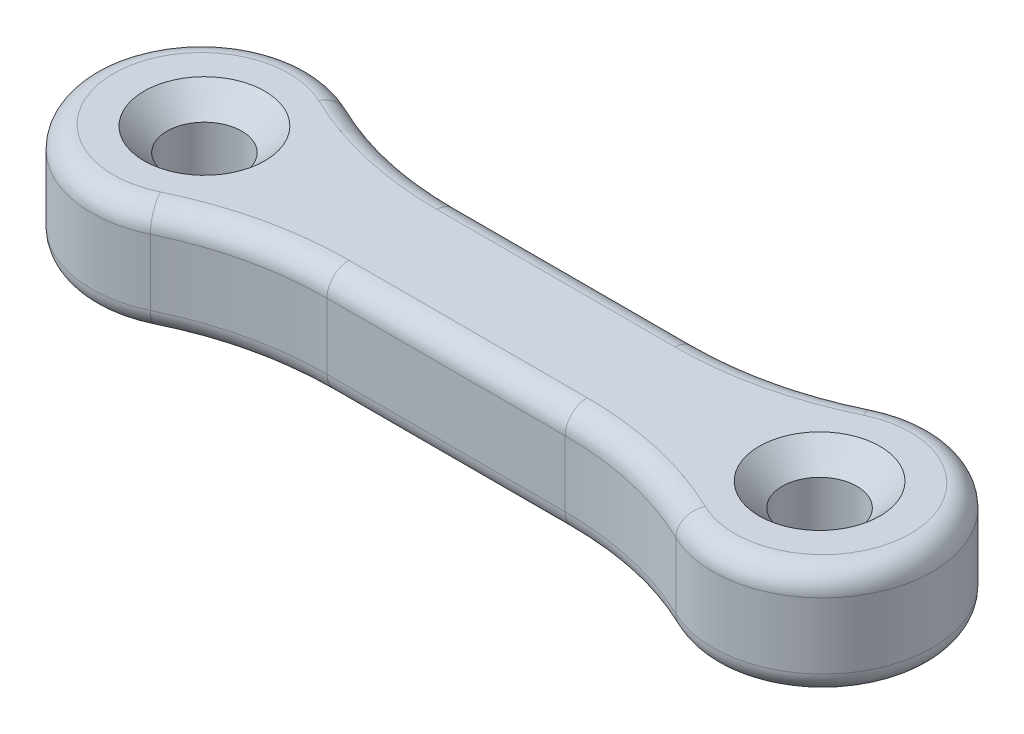
ISO-10303-21;
HEADER;
FILE_DESCRIPTION(('STEP AP214'),'2;1');
FILE_NAME('part.step','',(''),(''),'','','');
FILE_SCHEMA(('AUTOMOTIVE_DESIGN { 1 0 10303 214 1 1 1 1 }'));
ENDSEC;
DATA;
#1=APPLICATION_CONTEXT('core data for automotive mechanical design processes');
#2=APPLICATION_PROTOCOL_DEFINITION('international standard','automotive_design',2000,#1);
#3=PRODUCT_CONTEXT('',#1,'mechanical');
#4=PRODUCT('Part','Part','',(#3));
#5=PRODUCT_RELATED_PRODUCT_CATEGORY('part','',(#4));
#6=PRODUCT_DEFINITION_FORMATION('','',#4);
#7=PRODUCT_DEFINITION_CONTEXT('part definition',#1,'design');
#8=PRODUCT_DEFINITION('design','',#6,#7);
#9=PRODUCT_DEFINITION_SHAPE('','',#8);
#10=(LENGTH_UNIT() NAMED_UNIT(*) SI_UNIT(.MILLI.,.METRE.));
#11=(NAMED_UNIT(*) PLANE_ANGLE_UNIT() SI_UNIT($,.RADIAN.));
#12=(NAMED_UNIT(*) SI_UNIT($,.STERADIAN.) SOLID_ANGLE_UNIT());
#13=UNCERTAINTY_MEASURE_WITH_UNIT(LENGTH_MEASURE(1.E-05),#10,'distance_accuracy_value','');
#14=(GEOMETRIC_REPRESENTATION_CONTEXT(3) GLOBAL_UNCERTAINTY_ASSIGNED_CONTEXT((#13)) GLOBAL_UNIT_ASSIGNED_CONTEXT((#10,
#11,#12)) REPRESENTATION_CONTEXT('',''));
#15=CARTESIAN_POINT('',(0.,0.,0.));
#16=DIRECTION('',(0.,0.,1.));
#17=DIRECTION('',(1.,0.,0.));
#18=AXIS2_PLACEMENT_3D('',#15,#16,#17);
#19=CARTESIAN_POINT('',(0.,5.,0.));
#20=DIRECTION('',(0.,-1.,0.));
#21=DIRECTION('',(0.,0.,-1.));
#22=AXIS2_PLACEMENT_3D('',#19,#20,#21);
#23=CYLINDRICAL_SURFACE('',#22,5.);
#24=DIRECTION('',(0.,-1.,0.));
#25=VECTOR('',#24,1.);
#26=CARTESIAN_POINT('',(2.17944947177033,5.,-4.5));
#27=LINE('',#26,#25);
#28=CARTESIAN_POINT('',(2.17944947177033,4.,-4.5));
#29=VERTEX_POINT('',#28);
#30=CARTESIAN_POINT('',(2.17944947177033,1.,-4.5));
#31=VERTEX_POINT('',#30);
#32=EDGE_CURVE('E244',#29,#31,#27,.T.);
#33=ORIENTED_EDGE('',*,*,#32,.T.);
#34=CARTESIAN_POINT('',(0.,1.,0.));
#35=DIRECTION('',(0.,-1.,0.));
#36=DIRECTION('',(0.,0.,-1.));
#37=AXIS2_PLACEMENT_3D('',#34,#35,#36);
#38=CIRCLE('',#37,5.);
#39=CARTESIAN_POINT('',(2.17944947177034,1.,4.5));
#40=VERTEX_POINT('',#39);
#41=EDGE_CURVE('E209',#31,#40,#38,.F.);
#42=ORIENTED_EDGE('',*,*,#41,.T.);
#43=DIRECTION('',(0.,-1.,0.));
#44=VECTOR('',#43,1.);
#45=CARTESIAN_POINT('',(2.17944947177034,5.,4.5));
#46=LINE('',#45,#44);
#47=CARTESIAN_POINT('',(2.17944947177034,4.,4.5));
#48=VERTEX_POINT('',#47);
#49=EDGE_CURVE('E172',#48,#40,#46,.T.);
#50=ORIENTED_EDGE('',*,*,#49,.F.);
#51=CARTESIAN_POINT('',(0.,4.,0.));
#52=DIRECTION('',(0.,-1.,0.));
#53=DIRECTION('',(0.,0.,-1.));
#54=AXIS2_PLACEMENT_3D('',#51,#52,#53);
#55=CIRCLE('',#54,5.);
#56=EDGE_CURVE('E207',#48,#29,#55,.T.);
#57=ORIENTED_EDGE('',*,*,#56,.T.);
#58=EDGE_LOOP('',(#33,#42,#50,#57));
#59=FACE_BOUND('',#58,.T.);
#60=ADVANCED_FACE('F36',(#59),#23,.T.);
#61=CARTESIAN_POINT('',(8.71779788708134,5.,18.));
#62=DIRECTION('',(0.,-1.,0.));
#63=DIRECTION('',(0.,0.,-1.));
#64=AXIS2_PLACEMENT_3D('',#61,#62,#63);
#65=CYLINDRICAL_SURFACE('',#64,15.);
#66=DIRECTION('',(0.,-1.,0.));
#67=VECTOR('',#66,1.);
#68=CARTESIAN_POINT('',(8.71779788708134,5.,3.));
#69=LINE('',#68,#67);
#70=CARTESIAN_POINT('',(8.71779788708134,4.,3.));
#71=VERTEX_POINT('',#70);
#72=CARTESIAN_POINT('',(8.71779788708134,1.,3.));
#73=VERTEX_POINT('',#72);
#74=EDGE_CURVE('E301',#71,#73,#69,.T.);
#75=ORIENTED_EDGE('',*,*,#74,.F.);
#76=CARTESIAN_POINT('',(8.71779788708134,4.,18.));
#77=DIRECTION('',(0.,-1.,0.));
#78=DIRECTION('',(0.,0.,-1.));
#79=AXIS2_PLACEMENT_3D('',#76,#77,#78);
#80=CIRCLE('',#79,15.);
#81=EDGE_CURVE('E11',#71,#48,#80,.F.);
#82=ORIENTED_EDGE('',*,*,#81,.T.);
#83=ORIENTED_EDGE('',*,*,#49,.T.);
#84=CARTESIAN_POINT('',(8.71779788708134,1.,18.));
#85=DIRECTION('',(0.,-1.,0.));
#86=DIRECTION('',(0.,0.,-1.));
#87=AXIS2_PLACEMENT_3D('',#84,#85,#86);
#88=CIRCLE('',#87,15.);
#89=EDGE_CURVE('E45',#40,#73,#88,.T.);
#90=ORIENTED_EDGE('',*,*,#89,.T.);
#91=EDGE_LOOP('',(#75,#82,#83,#90));
#92=FACE_BOUND('',#91,.T.);
#93=ADVANCED_FACE('F381',(#92),#65,.F.);
#94=CARTESIAN_POINT('',(19.5622021129187,5.,3.));
#95=DIRECTION('',(0.,0.,1.));
#96=DIRECTION('',(1.,0.,0.));
#97=AXIS2_PLACEMENT_3D('',#94,#95,#96);
#98=PLANE('',#97);
#99=ORIENTED_EDGE('',*,*,#74,.T.);
#100=DIRECTION('',(-1.,0.,0.));
#101=VECTOR('',#100,1.);
#102=CARTESIAN_POINT('',(19.5622021129187,1.,3.));
#103=LINE('',#102,#101);
#104=CARTESIAN_POINT('',(19.5622021129187,1.,3.));
#105=VERTEX_POINT('',#104);
#106=EDGE_CURVE('E159',#73,#105,#103,.F.);
#107=ORIENTED_EDGE('',*,*,#106,.T.);
#108=DIRECTION('',(0.,-1.,0.));
#109=VECTOR('',#108,1.);
#110=CARTESIAN_POINT('',(19.5622021129187,5.,3.));
#111=LINE('',#110,#109);
#112=CARTESIAN_POINT('',(19.5622021129187,4.,3.));
#113=VERTEX_POINT('',#112);
#114=EDGE_CURVE('E299',#113,#105,#111,.T.);
#115=ORIENTED_EDGE('',*,*,#114,.F.);
#116=DIRECTION('',(-1.,0.,0.));
#117=VECTOR('',#116,1.);
#118=CARTESIAN_POINT('',(8.71779788708134,4.,3.));
#119=LINE('',#118,#117);
#120=EDGE_CURVE('E178',#113,#71,#119,.T.);
#121=ORIENTED_EDGE('',*,*,#120,.T.);
#122=EDGE_LOOP('',(#99,#107,#115,#121));
#123=FACE_BOUND('',#122,.T.);
#124=ADVANCED_FACE('F330',(#123),#98,.T.);
#125=CARTESIAN_POINT('',(19.5622021129187,5.,18.));
#126=DIRECTION('',(0.,-1.,0.));
#127=DIRECTION('',(0.,0.,-1.));
#128=AXIS2_PLACEMENT_3D('',#125,#126,#127);
#129=CYLINDRICAL_SURFACE('',#128,15.);
#130=ORIENTED_EDGE('',*,*,#114,.T.);
#131=CARTESIAN_POINT('',(19.5622021129187,1.,18.));
#132=DIRECTION('',(0.,-1.,0.));
#133=DIRECTION('',(0.,0.,-1.));
#134=AXIS2_PLACEMENT_3D('',#131,#132,#133);
#135=CIRCLE('',#134,15.);
#136=CARTESIAN_POINT('',(26.1005505282297,1.,4.5));
#137=VERTEX_POINT('',#136);
#138=EDGE_CURVE('E189',#105,#137,#135,.T.);
#139=ORIENTED_EDGE('',*,*,#138,.T.);
#140=DIRECTION('',(0.,-1.,0.));
#141=VECTOR('',#140,1.);
#142=CARTESIAN_POINT('',(26.1005505282297,5.,4.5));
#143=LINE('',#142,#141);
#144=CARTESIAN_POINT('',(26.1005505282297,4.,4.5));
#145=VERTEX_POINT('',#144);
#146=EDGE_CURVE('E290',#145,#137,#143,.T.);
#147=ORIENTED_EDGE('',*,*,#146,.F.);
#148=CARTESIAN_POINT('',(19.5622021129187,4.,18.));
#149=DIRECTION('',(0.,-1.,0.));
#150=DIRECTION('',(0.,0.,-1.));
#151=AXIS2_PLACEMENT_3D('',#148,#149,#150);
#152=CIRCLE('',#151,15.);
#153=EDGE_CURVE('E186',#145,#113,#152,.F.);
#154=ORIENTED_EDGE('',*,*,#153,.T.);
#155=EDGE_LOOP('',(#130,#139,#147,#154));
#156=FACE_BOUND('',#155,.T.);
#157=ADVANCED_FACE('F296',(#156),#129,.F.);
#158=CARTESIAN_POINT('',(28.28,5.,0.));
#159=DIRECTION('',(0.,-1.,0.));
#160=DIRECTION('',(0.,0.,-1.));
#161=AXIS2_PLACEMENT_3D('',#158,#159,#160);
#162=CYLINDRICAL_SURFACE('',#161,5.);
#163=ORIENTED_EDGE('',*,*,#146,.T.);
#164=CARTESIAN_POINT('',(28.28,1.,0.));
#165=DIRECTION('',(0.,-1.,0.));
#166=DIRECTION('',(0.,0.,-1.));
#167=AXIS2_PLACEMENT_3D('',#164,#165,#166);
#168=CIRCLE('',#167,5.);
#169=CARTESIAN_POINT('',(26.1005505282297,1.,-4.5));
#170=VERTEX_POINT('',#169);
#171=EDGE_CURVE('E193',#137,#170,#168,.F.);
#172=ORIENTED_EDGE('',*,*,#171,.T.);
#173=DIRECTION('',(0.,-1.,0.));
#174=VECTOR('',#173,1.);
#175=CARTESIAN_POINT('',(26.1005505282297,5.,-4.5));
#176=LINE('',#175,#174);
#177=CARTESIAN_POINT('',(26.1005505282297,4.,-4.5));
#178=VERTEX_POINT('',#177);
#179=EDGE_CURVE('E293',#178,#170,#176,.T.);
#180=ORIENTED_EDGE('',*,*,#179,.F.);
#181=CARTESIAN_POINT('',(28.28,4.,0.));
#182=DIRECTION('',(0.,-1.,0.));
#183=DIRECTION('',(0.,0.,-1.));
#184=AXIS2_PLACEMENT_3D('',#181,#182,#183);
#185=CIRCLE('',#184,5.);
#186=EDGE_CURVE('E191',#178,#145,#185,.T.);
#187=ORIENTED_EDGE('',*,*,#186,.T.);
#188=EDGE_LOOP('',(#163,#172,#180,#187));
#189=FACE_BOUND('',#188,.T.);
#190=ADVANCED_FACE('F289',(#189),#162,.T.);
#191=CARTESIAN_POINT('',(19.5622021129187,5.,-18.));
#192=DIRECTION('',(0.,-1.,0.));
#193=DIRECTION('',(0.,0.,-1.));
#194=AXIS2_PLACEMENT_3D('',#191,#192,#193);
#195=CYLINDRICAL_SURFACE('',#194,15.);
#196=ORIENTED_EDGE('',*,*,#179,.T.);
#197=CARTESIAN_POINT('',(19.5622021129187,1.,-18.));
#198=DIRECTION('',(0.,-1.,0.));
#199=DIRECTION('',(0.,0.,-1.));
#200=AXIS2_PLACEMENT_3D('',#197,#198,#199);
#201=CIRCLE('',#200,15.);
#202=CARTESIAN_POINT('',(19.5622021129187,1.,-3.));
#203=VERTEX_POINT('',#202);
#204=EDGE_CURVE('E197',#170,#203,#201,.T.);
#205=ORIENTED_EDGE('',*,*,#204,.T.);
#206=DIRECTION('',(0.,-1.,0.));
#207=VECTOR('',#206,1.);
#208=CARTESIAN_POINT('',(19.5622021129187,5.,-3.));
#209=LINE('',#208,#207);
#210=CARTESIAN_POINT('',(19.5622021129187,4.,-3.));
#211=VERTEX_POINT('',#210);
#212=EDGE_CURVE('E303',#211,#203,#209,.T.);
#213=ORIENTED_EDGE('',*,*,#212,.F.);
#214=CARTESIAN_POINT('',(19.5622021129187,4.,-18.));
#215=DIRECTION('',(0.,-1.,0.));
#216=DIRECTION('',(0.,0.,-1.));
#217=AXIS2_PLACEMENT_3D('',#214,#215,#216);
#218=CIRCLE('',#217,15.);
#219=EDGE_CURVE('E195',#211,#178,#218,.F.);
#220=ORIENTED_EDGE('',*,*,#219,.T.);
#221=EDGE_LOOP('',(#196,#205,#213,#220));
#222=FACE_BOUND('',#221,.T.);
#223=ADVANCED_FACE('F457',(#222),#195,.F.);
#224=CARTESIAN_POINT('',(8.71779788708134,5.,-3.));
#225=DIRECTION('',(0.,0.,-1.));
#226=DIRECTION('',(-1.,0.,0.));
#227=AXIS2_PLACEMENT_3D('',#224,#225,#226);
#228=PLANE('',#227);
#229=ORIENTED_EDGE('',*,*,#212,.T.);
#230=DIRECTION('',(1.,0.,0.));
#231=VECTOR('',#230,1.);
#232=CARTESIAN_POINT('',(8.71779788708134,1.,-3.));
#233=LINE('',#232,#231);
#234=CARTESIAN_POINT('',(8.71779788708134,1.,-3.));
#235=VERTEX_POINT('',#234);
#236=EDGE_CURVE('E201',#203,#235,#233,.F.);
#237=ORIENTED_EDGE('',*,*,#236,.T.);
#238=DIRECTION('',(0.,-1.,0.));
#239=VECTOR('',#238,1.);
#240=CARTESIAN_POINT('',(8.71779788708134,5.,-3.));
#241=LINE('',#240,#239);
#242=CARTESIAN_POINT('',(8.71779788708134,4.,-3.));
#243=VERTEX_POINT('',#242);
#244=EDGE_CURVE('E309',#243,#235,#241,.T.);
#245=ORIENTED_EDGE('',*,*,#244,.F.);
#246=DIRECTION('',(1.,0.,0.));
#247=VECTOR('',#246,1.);
#248=CARTESIAN_POINT('',(19.5622021129187,4.,-3.));
#249=LINE('',#248,#247);
#250=EDGE_CURVE('E199',#243,#211,#249,.T.);
#251=ORIENTED_EDGE('',*,*,#250,.T.);
#252=EDGE_LOOP('',(#229,#237,#245,#251));
#253=FACE_BOUND('',#252,.T.);
#254=ADVANCED_FACE('F450',(#253),#228,.T.);
#255=CARTESIAN_POINT('',(8.71779788708134,5.,-18.));
#256=DIRECTION('',(0.,-1.,0.));
#257=DIRECTION('',(0.,0.,-1.));
#258=AXIS2_PLACEMENT_3D('',#255,#256,#257);
#259=CYLINDRICAL_SURFACE('',#258,15.);
#260=ORIENTED_EDGE('',*,*,#244,.T.);
#261=CARTESIAN_POINT('',(8.71779788708134,1.,-18.));
#262=DIRECTION('',(0.,-1.,0.));
#263=DIRECTION('',(0.,0.,-1.));
#264=AXIS2_PLACEMENT_3D('',#261,#262,#263);
#265=CIRCLE('',#264,15.);
#266=EDGE_CURVE('E205',#235,#31,#265,.T.);
#267=ORIENTED_EDGE('',*,*,#266,.T.);
#268=ORIENTED_EDGE('',*,*,#32,.F.);
#269=CARTESIAN_POINT('',(8.71779788708134,4.,-18.));
#270=DIRECTION('',(0.,-1.,0.));
#271=DIRECTION('',(0.,0.,-1.));
#272=AXIS2_PLACEMENT_3D('',#269,#270,#271);
#273=CIRCLE('',#272,15.);
#274=EDGE_CURVE('E203',#29,#243,#273,.F.);
#275=ORIENTED_EDGE('',*,*,#274,.T.);
#276=EDGE_LOOP('',(#260,#267,#268,#275));
#277=FACE_BOUND('',#276,.T.);
#278=ADVANCED_FACE('F360',(#277),#259,.F.);
#279=CARTESIAN_POINT('',(0.,5.,0.));
#280=DIRECTION('',(0.,-1.,0.));
#281=DIRECTION('',(0.,0.,-1.));
#282=AXIS2_PLACEMENT_3D('',#279,#280,#281);
#283=PLANE('',#282);
#284=CARTESIAN_POINT('',(28.14,5.,0.));
#285=DIRECTION('',(0.,1.,0.));
#286=DIRECTION('',(0.,0.,1.));
#287=AXIS2_PLACEMENT_3D('',#284,#285,#286);
#288=CIRCLE('',#287,2.75);
#289=CARTESIAN_POINT('',(28.14,5.,2.75));
#290=VERTEX_POINT('',#289);
#291=EDGE_CURVE('E352',#290,#290,#288,.T.);
#292=ORIENTED_EDGE('',*,*,#291,.F.);
#293=EDGE_LOOP('',(#292));
#294=FACE_BOUND('',#293,.T.);
#295=CARTESIAN_POINT('',(0.140000000000003,5.,0.));
#296=DIRECTION('',(0.,1.,0.));
#297=DIRECTION('',(0.,0.,1.));
#298=AXIS2_PLACEMENT_3D('',#295,#296,#297);
#299=CIRCLE('',#298,2.75);
#300=CARTESIAN_POINT('',(0.140000000000003,5.,2.75));
#301=VERTEX_POINT('',#300);
#302=EDGE_CURVE('E343',#301,#301,#299,.T.);
#303=ORIENTED_EDGE('',*,*,#302,.F.);
#304=EDGE_LOOP('',(#303));
#305=FACE_BOUND('',#304,.T.);
#306=DIRECTION('',(-1.,0.,0.));
#307=VECTOR('',#306,1.);
#308=CARTESIAN_POINT('',(19.5622021129187,5.,2.));
#309=LINE('',#308,#307);
#310=CARTESIAN_POINT('',(8.71779788708134,5.,2.));
#311=VERTEX_POINT('',#310);
#312=CARTESIAN_POINT('',(19.5622021129187,5.,2.));
#313=VERTEX_POINT('',#312);
#314=EDGE_CURVE('E211',#311,#313,#309,.F.);
#315=ORIENTED_EDGE('',*,*,#314,.T.);
#316=CARTESIAN_POINT('',(19.5622021129187,5.,18.));
#317=DIRECTION('',(0.,-1.,0.));
#318=DIRECTION('',(0.,0.,-1.));
#319=AXIS2_PLACEMENT_3D('',#316,#317,#318);
#320=CIRCLE('',#319,16.);
#321=CARTESIAN_POINT('',(26.5364404225837,5.,3.6));
#322=VERTEX_POINT('',#321);
#323=EDGE_CURVE('E224',#313,#322,#320,.T.);
#324=ORIENTED_EDGE('',*,*,#323,.T.);
#325=CARTESIAN_POINT('',(28.28,5.,0.));
#326=DIRECTION('',(0.,-1.,0.));
#327=DIRECTION('',(0.,0.,-1.));
#328=AXIS2_PLACEMENT_3D('',#325,#326,#327);
#329=CIRCLE('',#328,4.);
#330=CARTESIAN_POINT('',(26.5364404225837,5.,-3.6));
#331=VERTEX_POINT('',#330);
#332=EDGE_CURVE('E60',#322,#331,#329,.F.);
#333=ORIENTED_EDGE('',*,*,#332,.T.);
#334=CARTESIAN_POINT('',(19.5622021129187,5.,-18.));
#335=DIRECTION('',(0.,-1.,0.));
#336=DIRECTION('',(0.,0.,-1.));
#337=AXIS2_PLACEMENT_3D('',#334,#335,#336);
#338=CIRCLE('',#337,16.);
#339=CARTESIAN_POINT('',(19.5622021129187,5.,-2.));
#340=VERTEX_POINT('',#339);
#341=EDGE_CURVE('E221',#331,#340,#338,.T.);
#342=ORIENTED_EDGE('',*,*,#341,.T.);
#343=DIRECTION('',(1.,0.,0.));
#344=VECTOR('',#343,1.);
#345=CARTESIAN_POINT('',(8.71779788708134,5.,-2.));
#346=LINE('',#345,#344);
#347=CARTESIAN_POINT('',(8.71779788708134,5.,-2.));
#348=VERTEX_POINT('',#347);
#349=EDGE_CURVE('E219',#340,#348,#346,.F.);
#350=ORIENTED_EDGE('',*,*,#349,.T.);
#351=CARTESIAN_POINT('',(8.71779788708134,5.,-18.));
#352=DIRECTION('',(0.,-1.,0.));
#353=DIRECTION('',(0.,0.,-1.));
#354=AXIS2_PLACEMENT_3D('',#351,#352,#353);
#355=CIRCLE('',#354,16.);
#356=CARTESIAN_POINT('',(1.74355957741627,5.,-3.6));
#357=VERTEX_POINT('',#356);
#358=EDGE_CURVE('E217',#348,#357,#355,.T.);
#359=ORIENTED_EDGE('',*,*,#358,.T.);
#360=CARTESIAN_POINT('',(0.,5.,0.));
#361=DIRECTION('',(0.,-1.,0.));
#362=DIRECTION('',(0.,0.,-1.));
#363=AXIS2_PLACEMENT_3D('',#360,#361,#362);
#364=CIRCLE('',#363,4.);
#365=CARTESIAN_POINT('',(1.74355957741627,5.,3.6));
#366=VERTEX_POINT('',#365);
#367=EDGE_CURVE('E215',#357,#366,#364,.F.);
#368=ORIENTED_EDGE('',*,*,#367,.T.);
#369=CARTESIAN_POINT('',(8.71779788708134,5.,18.));
#370=DIRECTION('',(0.,-1.,0.));
#371=DIRECTION('',(0.,0.,-1.));
#372=AXIS2_PLACEMENT_3D('',#369,#370,#371);
#373=CIRCLE('',#372,16.);
#374=EDGE_CURVE('E213',#366,#311,#373,.T.);
#375=ORIENTED_EDGE('',*,*,#374,.T.);
#376=EDGE_LOOP('',(#315,#324,#333,#342,#350,#359,#368,#375));
#377=FACE_BOUND('',#376,.T.);
#378=ADVANCED_FACE('F276',(#294,#305,#377),#283,.F.);
#379=CARTESIAN_POINT('',(0.,0.,0.));
#380=DIRECTION('',(0.,-1.,0.));
#381=DIRECTION('',(0.,0.,-1.));
#382=AXIS2_PLACEMENT_3D('',#379,#380,#381);
#383=PLANE('',#382);
#384=CARTESIAN_POINT('',(28.14,0.,0.));
#385=DIRECTION('',(0.,1.,0.));
#386=DIRECTION('',(0.,0.,1.));
#387=AXIS2_PLACEMENT_3D('',#384,#385,#386);
#388=CIRCLE('',#387,1.7);
#389=CARTESIAN_POINT('',(28.14,0.,1.7));
#390=VERTEX_POINT('',#389);
#391=EDGE_CURVE('E346',#390,#390,#388,.T.);
#392=ORIENTED_EDGE('',*,*,#391,.T.);
#393=EDGE_LOOP('',(#392));
#394=FACE_BOUND('',#393,.T.);
#395=CARTESIAN_POINT('',(0.140000000000003,0.,0.));
#396=DIRECTION('',(0.,1.,0.));
#397=DIRECTION('',(0.,0.,1.));
#398=AXIS2_PLACEMENT_3D('',#395,#396,#397);
#399=CIRCLE('',#398,1.7);
#400=CARTESIAN_POINT('',(0.140000000000003,0.,1.7));
#401=VERTEX_POINT('',#400);
#402=EDGE_CURVE('E247',#401,#401,#399,.T.);
#403=ORIENTED_EDGE('',*,*,#402,.T.);
#404=EDGE_LOOP('',(#403));
#405=FACE_BOUND('',#404,.T.);
#406=CARTESIAN_POINT('',(19.5622021129187,0.,18.));
#407=DIRECTION('',(0.,-1.,0.));
#408=DIRECTION('',(0.,0.,-1.));
#409=AXIS2_PLACEMENT_3D('',#406,#407,#408);
#410=CIRCLE('',#409,16.);
#411=CARTESIAN_POINT('',(26.5364404225837,0.,3.6));
#412=VERTEX_POINT('',#411);
#413=CARTESIAN_POINT('',(19.5622021129187,0.,2.));
#414=VERTEX_POINT('',#413);
#415=EDGE_CURVE('E176',#412,#414,#410,.F.);
#416=ORIENTED_EDGE('',*,*,#415,.T.);
#417=DIRECTION('',(-1.,0.,0.));
#418=VECTOR('',#417,1.);
#419=CARTESIAN_POINT('',(0.,0.,2.));
#420=LINE('',#419,#418);
#421=CARTESIAN_POINT('',(8.71779788708134,0.,2.));
#422=VERTEX_POINT('',#421);
#423=EDGE_CURVE('E157',#414,#422,#420,.T.);
#424=ORIENTED_EDGE('',*,*,#423,.T.);
#425=CARTESIAN_POINT('',(8.71779788708134,0.,18.));
#426=DIRECTION('',(0.,-1.,0.));
#427=DIRECTION('',(0.,0.,-1.));
#428=AXIS2_PLACEMENT_3D('',#425,#426,#427);
#429=CIRCLE('',#428,16.);
#430=CARTESIAN_POINT('',(1.74355957741627,0.,3.6));
#431=VERTEX_POINT('',#430);
#432=EDGE_CURVE('E165',#422,#431,#429,.F.);
#433=ORIENTED_EDGE('',*,*,#432,.T.);
#434=CARTESIAN_POINT('',(0.,0.,0.));
#435=DIRECTION('',(0.,-1.,0.));
#436=DIRECTION('',(0.,0.,-1.));
#437=AXIS2_PLACEMENT_3D('',#434,#435,#436);
#438=CIRCLE('',#437,4.);
#439=CARTESIAN_POINT('',(1.74355957741627,0.,-3.6));
#440=VERTEX_POINT('',#439);
#441=EDGE_CURVE('E171',#431,#440,#438,.T.);
#442=ORIENTED_EDGE('',*,*,#441,.T.);
#443=CARTESIAN_POINT('',(8.71779788708134,0.,-18.));
#444=DIRECTION('',(0.,-1.,0.));
#445=DIRECTION('',(0.,0.,-1.));
#446=AXIS2_PLACEMENT_3D('',#443,#444,#445);
#447=CIRCLE('',#446,16.);
#448=CARTESIAN_POINT('',(8.71779788708134,0.,-2.));
#449=VERTEX_POINT('',#448);
#450=EDGE_CURVE('E315',#440,#449,#447,.F.);
#451=ORIENTED_EDGE('',*,*,#450,.T.);
#452=DIRECTION('',(1.,0.,0.));
#453=VECTOR('',#452,1.);
#454=CARTESIAN_POINT('',(0.,0.,-2.));
#455=LINE('',#454,#453);
#456=CARTESIAN_POINT('',(19.5622021129187,0.,-2.));
#457=VERTEX_POINT('',#456);
#458=EDGE_CURVE('E317',#449,#457,#455,.T.);
#459=ORIENTED_EDGE('',*,*,#458,.T.);
#460=CARTESIAN_POINT('',(19.5622021129187,0.,-18.));
#461=DIRECTION('',(0.,-1.,0.));
#462=DIRECTION('',(0.,0.,-1.));
#463=AXIS2_PLACEMENT_3D('',#460,#461,#462);
#464=CIRCLE('',#463,16.);
#465=CARTESIAN_POINT('',(26.5364404225837,0.,-3.6));
#466=VERTEX_POINT('',#465);
#467=EDGE_CURVE('E319',#457,#466,#464,.F.);
#468=ORIENTED_EDGE('',*,*,#467,.T.);
#469=CARTESIAN_POINT('',(28.28,0.,0.));
#470=DIRECTION('',(0.,-1.,0.));
#471=DIRECTION('',(0.,0.,-1.));
#472=AXIS2_PLACEMENT_3D('',#469,#470,#471);
#473=CIRCLE('',#472,4.);
#474=EDGE_CURVE('E181',#466,#412,#473,.T.);
#475=ORIENTED_EDGE('',*,*,#474,.T.);
#476=EDGE_LOOP('',(#416,#424,#433,#442,#451,#459,#468,#475));
#477=FACE_BOUND('',#476,.T.);
#478=ADVANCED_FACE('F174',(#394,#405,#477),#383,.T.);
#479=CARTESIAN_POINT('',(0.,1.,-2.));
#480=DIRECTION('',(1.,0.,0.));
#481=DIRECTION('',(0.,0.,-1.));
#482=AXIS2_PLACEMENT_3D('',#479,#480,#481);
#483=CYLINDRICAL_SURFACE('',#482,1.);
#484=CARTESIAN_POINT('',(8.71779788708134,1.,-2.));
#485=DIRECTION('',(-1.,0.,0.));
#486=DIRECTION('',(0.,0.,1.));
#487=AXIS2_PLACEMENT_3D('',#484,#485,#486);
#488=CIRCLE('',#487,1.);
#489=EDGE_CURVE('E238',#235,#449,#488,.T.);
#490=ORIENTED_EDGE('',*,*,#489,.F.);
#491=ORIENTED_EDGE('',*,*,#236,.F.);
#492=CARTESIAN_POINT('',(19.5622021129187,1.,-2.));
#493=DIRECTION('',(1.,0.,0.));
#494=DIRECTION('',(0.,0.,-1.));
#495=AXIS2_PLACEMENT_3D('',#492,#493,#494);
#496=CIRCLE('',#495,1.);
#497=EDGE_CURVE('E241',#457,#203,#496,.T.);
#498=ORIENTED_EDGE('',*,*,#497,.F.);
#499=ORIENTED_EDGE('',*,*,#458,.F.);
#500=EDGE_LOOP('',(#490,#491,#498,#499));
#501=FACE_BOUND('',#500,.T.);
#502=ADVANCED_FACE('F410',(#501),#483,.T.);
#503=CARTESIAN_POINT('',(19.5622021129187,1.,-18.));
#504=DIRECTION('',(0.,-1.,0.));
#505=DIRECTION('',(0.,0.,-1.));
#506=AXIS2_PLACEMENT_3D('',#503,#504,#505);
#507=TOROIDAL_SURFACE('',#506,16.,1.);
#508=ORIENTED_EDGE('',*,*,#497,.T.);
#509=ORIENTED_EDGE('',*,*,#204,.F.);
#510=CARTESIAN_POINT('',(26.5364404225837,1.,-3.6));
#511=DIRECTION('',(0.9,0.,-0.435889894354068));
#512=DIRECTION('',(-0.435889894354068,0.,-0.9));
#513=AXIS2_PLACEMENT_3D('',#510,#511,#512);
#514=CIRCLE('',#513,1.);
#515=EDGE_CURVE('E235',#466,#170,#514,.T.);
#516=ORIENTED_EDGE('',*,*,#515,.F.);
#517=ORIENTED_EDGE('',*,*,#467,.F.);
#518=EDGE_LOOP('',(#508,#509,#516,#517));
#519=FACE_BOUND('',#518,.T.);
#520=ADVANCED_FACE('F406',(#519),#507,.T.);
#521=CARTESIAN_POINT('',(8.71779788708134,1.,-18.));
#522=DIRECTION('',(0.,-1.,0.));
#523=DIRECTION('',(0.,0.,-1.));
#524=AXIS2_PLACEMENT_3D('',#521,#522,#523);
#525=TOROIDAL_SURFACE('',#524,16.,1.);
#526=ORIENTED_EDGE('',*,*,#489,.T.);
#527=ORIENTED_EDGE('',*,*,#450,.F.);
#528=CARTESIAN_POINT('',(1.74355957741627,1.,-3.6));
#529=DIRECTION('',(-0.9,0.,-0.435889894354067));
#530=DIRECTION('',(-0.435889894354067,0.,0.9));
#531=AXIS2_PLACEMENT_3D('',#528,#529,#530);
#532=CIRCLE('',#531,1.);
#533=EDGE_CURVE('E232',#31,#440,#532,.T.);
#534=ORIENTED_EDGE('',*,*,#533,.F.);
#535=ORIENTED_EDGE('',*,*,#266,.F.);
#536=EDGE_LOOP('',(#526,#527,#534,#535));
#537=FACE_BOUND('',#536,.T.);
#538=ADVANCED_FACE('F403',(#537),#525,.T.);
#539=CARTESIAN_POINT('',(28.28,1.,0.));
#540=DIRECTION('',(0.,-1.,0.));
#541=DIRECTION('',(0.,0.,-1.));
#542=AXIS2_PLACEMENT_3D('',#539,#540,#541);
#543=TOROIDAL_SURFACE('',#542,4.,1.);
#544=ORIENTED_EDGE('',*,*,#515,.T.);
#545=ORIENTED_EDGE('',*,*,#171,.F.);
#546=CARTESIAN_POINT('',(26.5364404225837,1.,3.6));
#547=DIRECTION('',(-0.9,0.,-0.435889894354068));
#548=DIRECTION('',(-0.435889894354068,0.,0.9));
#549=AXIS2_PLACEMENT_3D('',#546,#547,#548);
#550=CIRCLE('',#549,1.);
#551=EDGE_CURVE('E229',#412,#137,#550,.T.);
#552=ORIENTED_EDGE('',*,*,#551,.F.);
#553=ORIENTED_EDGE('',*,*,#474,.F.);
#554=EDGE_LOOP('',(#544,#545,#552,#553));
#555=FACE_BOUND('',#554,.T.);
#556=ADVANCED_FACE('F325',(#555),#543,.T.);
#557=CARTESIAN_POINT('',(0.,1.,0.));
#558=DIRECTION('',(0.,-1.,0.));
#559=DIRECTION('',(0.,0.,-1.));
#560=AXIS2_PLACEMENT_3D('',#557,#558,#559);
#561=TOROIDAL_SURFACE('',#560,4.,1.);
#562=ORIENTED_EDGE('',*,*,#533,.T.);
#563=ORIENTED_EDGE('',*,*,#441,.F.);
#564=CARTESIAN_POINT('',(1.74355957741627,1.,3.6));
#565=DIRECTION('',(0.9,0.,-0.435889894354068));
#566=DIRECTION('',(-0.435889894354068,0.,-0.9));
#567=AXIS2_PLACEMENT_3D('',#564,#565,#566);
#568=CIRCLE('',#567,1.);
#569=EDGE_CURVE('E168',#40,#431,#568,.T.);
#570=ORIENTED_EDGE('',*,*,#569,.F.);
#571=ORIENTED_EDGE('',*,*,#41,.F.);
#572=EDGE_LOOP('',(#562,#563,#570,#571));
#573=FACE_BOUND('',#572,.T.);
#574=ADVANCED_FACE('F397',(#573),#561,.T.);
#575=CARTESIAN_POINT('',(19.5622021129187,1.,18.));
#576=DIRECTION('',(0.,-1.,0.));
#577=DIRECTION('',(0.,0.,-1.));
#578=AXIS2_PLACEMENT_3D('',#575,#576,#577);
#579=TOROIDAL_SURFACE('',#578,16.,1.);
#580=ORIENTED_EDGE('',*,*,#551,.T.);
#581=ORIENTED_EDGE('',*,*,#138,.F.);
#582=CARTESIAN_POINT('',(19.5622021129187,1.,2.));
#583=DIRECTION('',(-1.,0.,0.));
#584=DIRECTION('',(0.,0.,1.));
#585=AXIS2_PLACEMENT_3D('',#582,#583,#584);
#586=CIRCLE('',#585,1.);
#587=EDGE_CURVE('E162',#414,#105,#586,.T.);
#588=ORIENTED_EDGE('',*,*,#587,.F.);
#589=ORIENTED_EDGE('',*,*,#415,.F.);
#590=EDGE_LOOP('',(#580,#581,#588,#589));
#591=FACE_BOUND('',#590,.T.);
#592=ADVANCED_FACE('F327',(#591),#579,.T.);
#593=CARTESIAN_POINT('',(8.71779788708134,1.,18.));
#594=DIRECTION('',(0.,-1.,0.));
#595=DIRECTION('',(0.,0.,-1.));
#596=AXIS2_PLACEMENT_3D('',#593,#594,#595);
#597=TOROIDAL_SURFACE('',#596,16.,1.);
#598=ORIENTED_EDGE('',*,*,#569,.T.);
#599=ORIENTED_EDGE('',*,*,#432,.F.);
#600=CARTESIAN_POINT('',(8.71779788708134,1.,2.));
#601=DIRECTION('',(1.,0.,0.));
#602=DIRECTION('',(0.,0.,-1.));
#603=AXIS2_PLACEMENT_3D('',#600,#601,#602);
#604=CIRCLE('',#603,1.);
#605=EDGE_CURVE('E153',#73,#422,#604,.T.);
#606=ORIENTED_EDGE('',*,*,#605,.F.);
#607=ORIENTED_EDGE('',*,*,#89,.F.);
#608=EDGE_LOOP('',(#598,#599,#606,#607));
#609=FACE_BOUND('',#608,.T.);
#610=ADVANCED_FACE('F166',(#609),#597,.T.);
#611=CARTESIAN_POINT('',(0.,1.,2.));
#612=DIRECTION('',(-1.,0.,0.));
#613=DIRECTION('',(0.,0.,1.));
#614=AXIS2_PLACEMENT_3D('',#611,#612,#613);
#615=CYLINDRICAL_SURFACE('',#614,1.);
#616=ORIENTED_EDGE('',*,*,#587,.T.);
#617=ORIENTED_EDGE('',*,*,#106,.F.);
#618=ORIENTED_EDGE('',*,*,#605,.T.);
#619=ORIENTED_EDGE('',*,*,#423,.F.);
#620=EDGE_LOOP('',(#616,#617,#618,#619));
#621=FACE_BOUND('',#620,.T.);
#622=ADVANCED_FACE('F155',(#621),#615,.T.);
#623=CARTESIAN_POINT('',(8.71779788708134,4.,-18.));
#624=DIRECTION('',(0.,-1.,0.));
#625=DIRECTION('',(0.,0.,-1.));
#626=AXIS2_PLACEMENT_3D('',#623,#624,#625);
#627=TOROIDAL_SURFACE('',#626,16.,1.);
#628=CARTESIAN_POINT('',(1.74355957741627,4.,-3.6));
#629=DIRECTION('',(-0.9,0.,-0.435889894354067));
#630=DIRECTION('',(-0.435889894354067,0.,0.9));
#631=AXIS2_PLACEMENT_3D('',#628,#629,#630);
#632=CIRCLE('',#631,1.);
#633=EDGE_CURVE('E260',#357,#29,#632,.T.);
#634=ORIENTED_EDGE('',*,*,#633,.F.);
#635=ORIENTED_EDGE('',*,*,#358,.F.);
#636=CARTESIAN_POINT('',(8.71779788708134,4.,-2.));
#637=DIRECTION('',(1.,0.,0.));
#638=DIRECTION('',(0.,0.,-1.));
#639=AXIS2_PLACEMENT_3D('',#636,#637,#638);
#640=CIRCLE('',#639,1.);
#641=EDGE_CURVE('E40',#243,#348,#640,.T.);
#642=ORIENTED_EDGE('',*,*,#641,.F.);
#643=ORIENTED_EDGE('',*,*,#274,.F.);
#644=EDGE_LOOP('',(#634,#635,#642,#643));
#645=FACE_BOUND('',#644,.T.);
#646=ADVANCED_FACE('F38',(#645),#627,.T.);
#647=CARTESIAN_POINT('',(8.71779788708134,4.,-2.));
#648=DIRECTION('',(-1.,0.,0.));
#649=DIRECTION('',(0.,0.,1.));
#650=AXIS2_PLACEMENT_3D('',#647,#648,#649);
#651=CYLINDRICAL_SURFACE('',#650,1.);
#652=ORIENTED_EDGE('',*,*,#641,.T.);
#653=ORIENTED_EDGE('',*,*,#349,.F.);
#654=CARTESIAN_POINT('',(19.5622021129187,4.,-2.));
#655=DIRECTION('',(1.,0.,0.));
#656=DIRECTION('',(0.,0.,-1.));
#657=AXIS2_PLACEMENT_3D('',#654,#655,#656);
#658=CIRCLE('',#657,1.);
#659=EDGE_CURVE('E258',#211,#340,#658,.T.);
#660=ORIENTED_EDGE('',*,*,#659,.F.);
#661=ORIENTED_EDGE('',*,*,#250,.F.);
#662=EDGE_LOOP('',(#652,#653,#660,#661));
#663=FACE_BOUND('',#662,.T.);
#664=ADVANCED_FACE('F271',(#663),#651,.T.);
#665=CARTESIAN_POINT('',(0.,4.,0.));
#666=DIRECTION('',(0.,-1.,0.));
#667=DIRECTION('',(0.,0.,-1.));
#668=AXIS2_PLACEMENT_3D('',#665,#666,#667);
#669=TOROIDAL_SURFACE('',#668,4.,1.);
#670=ORIENTED_EDGE('',*,*,#633,.T.);
#671=ORIENTED_EDGE('',*,*,#56,.F.);
#672=CARTESIAN_POINT('',(1.74355957741627,4.,3.6));
#673=DIRECTION('',(0.9,0.,-0.435889894354068));
#674=DIRECTION('',(-0.435889894354068,0.,-0.9));
#675=AXIS2_PLACEMENT_3D('',#672,#673,#674);
#676=CIRCLE('',#675,1.);
#677=EDGE_CURVE('E255',#366,#48,#676,.T.);
#678=ORIENTED_EDGE('',*,*,#677,.F.);
#679=ORIENTED_EDGE('',*,*,#367,.F.);
#680=EDGE_LOOP('',(#670,#671,#678,#679));
#681=FACE_BOUND('',#680,.T.);
#682=ADVANCED_FACE('F429',(#681),#669,.T.);
#683=CARTESIAN_POINT('',(19.5622021129187,4.,-18.));
#684=DIRECTION('',(0.,-1.,0.));
#685=DIRECTION('',(0.,0.,-1.));
#686=AXIS2_PLACEMENT_3D('',#683,#684,#685);
#687=TOROIDAL_SURFACE('',#686,16.,1.);
#688=ORIENTED_EDGE('',*,*,#659,.T.);
#689=ORIENTED_EDGE('',*,*,#341,.F.);
#690=CARTESIAN_POINT('',(26.5364404225837,4.,-3.6));
#691=DIRECTION('',(0.9,0.,-0.435889894354068));
#692=DIRECTION('',(-0.435889894354068,0.,-0.9));
#693=AXIS2_PLACEMENT_3D('',#690,#691,#692);
#694=CIRCLE('',#693,1.);
#695=EDGE_CURVE('E252',#178,#331,#694,.T.);
#696=ORIENTED_EDGE('',*,*,#695,.F.);
#697=ORIENTED_EDGE('',*,*,#219,.F.);
#698=EDGE_LOOP('',(#688,#689,#696,#697));
#699=FACE_BOUND('',#698,.T.);
#700=ADVANCED_FACE('F280',(#699),#687,.T.);
#701=CARTESIAN_POINT('',(8.71779788708134,4.,18.));
#702=DIRECTION('',(0.,-1.,0.));
#703=DIRECTION('',(0.,0.,-1.));
#704=AXIS2_PLACEMENT_3D('',#701,#702,#703);
#705=TOROIDAL_SURFACE('',#704,16.,1.);
#706=ORIENTED_EDGE('',*,*,#677,.T.);
#707=ORIENTED_EDGE('',*,*,#81,.F.);
#708=CARTESIAN_POINT('',(8.71779788708134,4.,2.));
#709=DIRECTION('',(1.,0.,0.));
#710=DIRECTION('',(0.,0.,-1.));
#711=AXIS2_PLACEMENT_3D('',#708,#709,#710);
#712=CIRCLE('',#711,1.);
#713=EDGE_CURVE('E249',#311,#71,#712,.T.);
#714=ORIENTED_EDGE('',*,*,#713,.F.);
#715=ORIENTED_EDGE('',*,*,#374,.F.);
#716=EDGE_LOOP('',(#706,#707,#714,#715));
#717=FACE_BOUND('',#716,.T.);
#718=ADVANCED_FACE('F423',(#717),#705,.T.);
#719=CARTESIAN_POINT('',(28.28,4.,0.));
#720=DIRECTION('',(0.,-1.,0.));
#721=DIRECTION('',(0.,0.,-1.));
#722=AXIS2_PLACEMENT_3D('',#719,#720,#721);
#723=TOROIDAL_SURFACE('',#722,4.,1.);
#724=ORIENTED_EDGE('',*,*,#695,.T.);
#725=ORIENTED_EDGE('',*,*,#332,.F.);
#726=CARTESIAN_POINT('',(26.5364404225837,4.,3.6));
#727=DIRECTION('',(-0.899999999999999,0.,-0.435889894354068));
#728=DIRECTION('',(-0.435889894354069,0.,0.9));
#729=AXIS2_PLACEMENT_3D('',#726,#727,#728);
#730=CIRCLE('',#729,1.);
#731=EDGE_CURVE('E53',#145,#322,#730,.T.);
#732=ORIENTED_EDGE('',*,*,#731,.F.);
#733=ORIENTED_EDGE('',*,*,#186,.F.);
#734=EDGE_LOOP('',(#724,#725,#732,#733));
#735=FACE_BOUND('',#734,.T.);
#736=ADVANCED_FACE('F284',(#735),#723,.T.);
#737=CARTESIAN_POINT('',(19.5622021129187,4.,2.));
#738=DIRECTION('',(1.,0.,0.));
#739=DIRECTION('',(0.,0.,-1.));
#740=AXIS2_PLACEMENT_3D('',#737,#738,#739);
#741=CYLINDRICAL_SURFACE('',#740,1.);
#742=ORIENTED_EDGE('',*,*,#713,.T.);
#743=ORIENTED_EDGE('',*,*,#120,.F.);
#744=CARTESIAN_POINT('',(19.5622021129187,4.,2.));
#745=DIRECTION('',(1.,0.,0.));
#746=DIRECTION('',(0.,0.,-1.));
#747=AXIS2_PLACEMENT_3D('',#744,#745,#746);
#748=CIRCLE('',#747,1.);
#749=EDGE_CURVE('E245',#313,#113,#748,.T.);
#750=ORIENTED_EDGE('',*,*,#749,.F.);
#751=ORIENTED_EDGE('',*,*,#314,.F.);
#752=EDGE_LOOP('',(#742,#743,#750,#751));
#753=FACE_BOUND('',#752,.T.);
#754=ADVANCED_FACE('F417',(#753),#741,.T.);
#755=CARTESIAN_POINT('',(19.5622021129187,4.,18.));
#756=DIRECTION('',(0.,-1.,0.));
#757=DIRECTION('',(0.,0.,-1.));
#758=AXIS2_PLACEMENT_3D('',#755,#756,#757);
#759=TOROIDAL_SURFACE('',#758,16.,1.);
#760=ORIENTED_EDGE('',*,*,#731,.T.);
#761=ORIENTED_EDGE('',*,*,#323,.F.);
#762=ORIENTED_EDGE('',*,*,#749,.T.);
#763=ORIENTED_EDGE('',*,*,#153,.F.);
#764=EDGE_LOOP('',(#760,#761,#762,#763));
#765=FACE_BOUND('',#764,.T.);
#766=ADVANCED_FACE('F376',(#765),#759,.T.);
#767=CARTESIAN_POINT('',(0.140000000000003,5.,0.));
#768=DIRECTION('',(0.,1.,0.));
#769=DIRECTION('',(0.,0.,1.));
#770=AXIS2_PLACEMENT_3D('',#767,#768,#769);
#771=CYLINDRICAL_SURFACE('',#770,1.69999999999999);
#772=ORIENTED_EDGE('',*,*,#402,.F.);
#773=EDGE_LOOP('',(#772));
#774=FACE_BOUND('',#773,.T.);
#775=CARTESIAN_POINT('',(0.140000000000003,3.94999999999999,0.));
#776=DIRECTION('',(0.,1.,0.));
#777=DIRECTION('',(0.,0.,1.));
#778=AXIS2_PLACEMENT_3D('',#775,#776,#777);
#779=CIRCLE('',#778,1.69999999999999);
#780=CARTESIAN_POINT('',(0.140000000000003,3.94999999999999,1.69999999999999));
#781=VERTEX_POINT('',#780);
#782=EDGE_CURVE('E340',#781,#781,#779,.T.);
#783=ORIENTED_EDGE('',*,*,#782,.T.);
#784=EDGE_LOOP('',(#783));
#785=FACE_BOUND('',#784,.T.);
#786=ADVANCED_FACE('F367',(#774,#785),#771,.F.);
#787=CARTESIAN_POINT('',(0.140000000000003,5.,0.));
#788=DIRECTION('',(0.,1.,0.));
#789=DIRECTION('',(0.,0.,1.));
#790=AXIS2_PLACEMENT_3D('',#787,#788,#789);
#791=CONICAL_SURFACE('',#790,2.75,0.785398163397448);
#792=ORIENTED_EDGE('',*,*,#782,.F.);
#793=EDGE_LOOP('',(#792));
#794=FACE_BOUND('',#793,.T.);
#795=ORIENTED_EDGE('',*,*,#302,.T.);
#796=EDGE_LOOP('',(#795));
#797=FACE_BOUND('',#796,.T.);
#798=ADVANCED_FACE('F364',(#794,#797),#791,.F.);
#799=CARTESIAN_POINT('',(28.14,5.,0.));
#800=DIRECTION('',(0.,1.,0.));
#801=DIRECTION('',(0.,0.,1.));
#802=AXIS2_PLACEMENT_3D('',#799,#800,#801);
#803=CYLINDRICAL_SURFACE('',#802,1.69999999999999);
#804=ORIENTED_EDGE('',*,*,#391,.F.);
#805=EDGE_LOOP('',(#804));
#806=FACE_BOUND('',#805,.T.);
#807=CARTESIAN_POINT('',(28.14,3.94999999999999,0.));
#808=DIRECTION('',(0.,1.,0.));
#809=DIRECTION('',(0.,0.,1.));
#810=AXIS2_PLACEMENT_3D('',#807,#808,#809);
#811=CIRCLE('',#810,1.69999999999999);
#812=CARTESIAN_POINT('',(28.14,3.94999999999999,1.69999999999999));
#813=VERTEX_POINT('',#812);
#814=EDGE_CURVE('E349',#813,#813,#811,.T.);
#815=ORIENTED_EDGE('',*,*,#814,.T.);
#816=EDGE_LOOP('',(#815));
#817=FACE_BOUND('',#816,.T.);
#818=ADVANCED_FACE('F366',(#806,#817),#803,.F.);
#819=CARTESIAN_POINT('',(28.14,5.,0.));
#820=DIRECTION('',(0.,1.,0.));
#821=DIRECTION('',(0.,0.,1.));
#822=AXIS2_PLACEMENT_3D('',#819,#820,#821);
#823=CONICAL_SURFACE('',#822,2.75,0.785398163397447);
#824=ORIENTED_EDGE('',*,*,#814,.F.);
#825=EDGE_LOOP('',(#824));
#826=FACE_BOUND('',#825,.T.);
#827=ORIENTED_EDGE('',*,*,#291,.T.);
#828=EDGE_LOOP('',(#827));
#829=FACE_BOUND('',#828,.T.);
#830=ADVANCED_FACE('F356',(#826,#829),#823,.F.);
#831=CLOSED_SHELL('',(#60,#93,#124,#157,#190,#223,#254,#278,#378,#478,#502,#520,#538,#556,#574,
#592,#610,#622,#646,#664,#682,#700,#718,#736,#754,#766,#786,#798,#818,#830));
#832=MANIFOLD_SOLID_BREP('B2',#831);
#833=ADVANCED_BREP_SHAPE_REPRESENTATION('',(#18,#832),#14);
#834=SHAPE_DEFINITION_REPRESENTATION(#9,#833);
ENDSEC;
END-ISO-10303-21;
